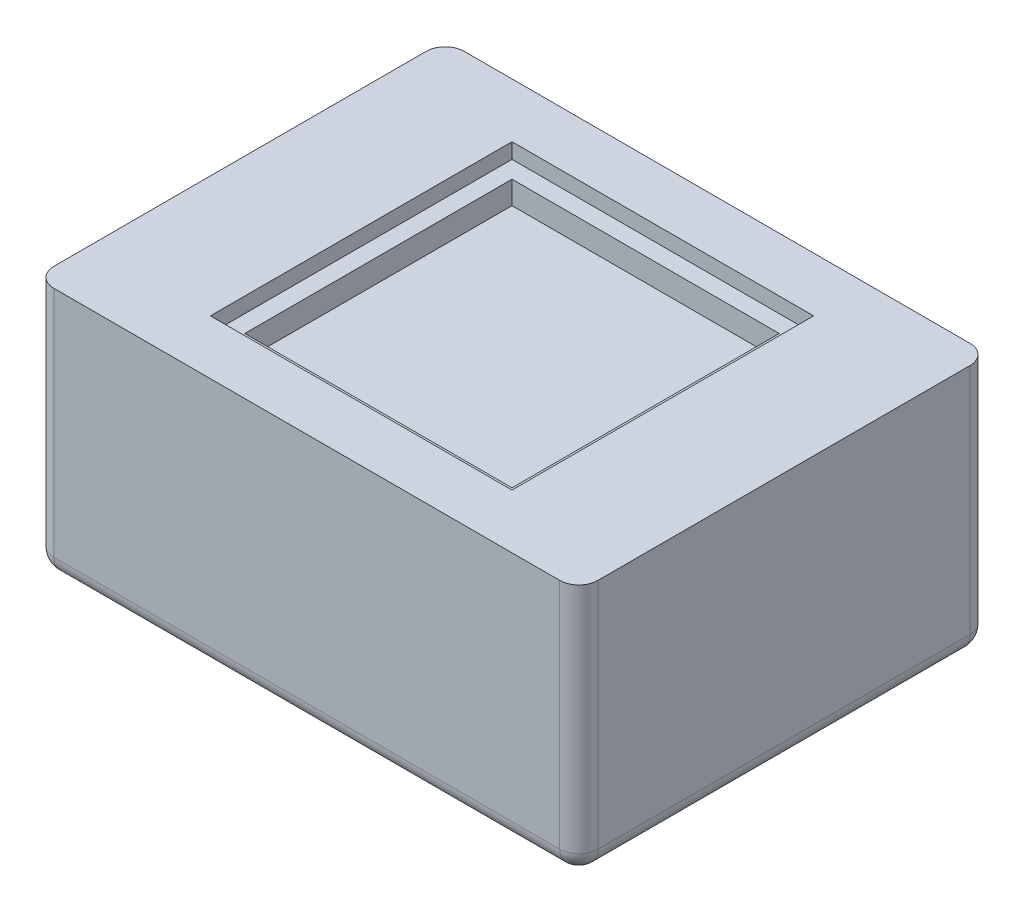
ISO-10303-21;
HEADER;
FILE_DESCRIPTION(('STEP AP214'),'2;1');
FILE_NAME('part.step','',(''),(''),'','','');
FILE_SCHEMA(('AUTOMOTIVE_DESIGN { 1 0 10303 214 1 1 1 1 }'));
ENDSEC;
DATA;
#1=APPLICATION_CONTEXT('core data for automotive mechanical design processes');
#2=APPLICATION_PROTOCOL_DEFINITION('international standard','automotive_design',2000,#1);
#3=PRODUCT_CONTEXT('',#1,'mechanical');
#4=PRODUCT('Part','Part','',(#3));
#5=PRODUCT_RELATED_PRODUCT_CATEGORY('part','',(#4));
#6=PRODUCT_DEFINITION_FORMATION('','',#4);
#7=PRODUCT_DEFINITION_CONTEXT('part definition',#1,'design');
#8=PRODUCT_DEFINITION('design','',#6,#7);
#9=PRODUCT_DEFINITION_SHAPE('','',#8);
#10=(LENGTH_UNIT() NAMED_UNIT(*) SI_UNIT(.MILLI.,.METRE.));
#11=(NAMED_UNIT(*) PLANE_ANGLE_UNIT() SI_UNIT($,.RADIAN.));
#12=(NAMED_UNIT(*) SI_UNIT($,.STERADIAN.) SOLID_ANGLE_UNIT());
#13=UNCERTAINTY_MEASURE_WITH_UNIT(LENGTH_MEASURE(1.E-05),#10,'distance_accuracy_value','');
#14=(GEOMETRIC_REPRESENTATION_CONTEXT(3) GLOBAL_UNCERTAINTY_ASSIGNED_CONTEXT((#13)) GLOBAL_UNIT_ASSIGNED_CONTEXT((#10,
#11,#12)) REPRESENTATION_CONTEXT('',''));
#15=CARTESIAN_POINT('',(0.,0.,0.));
#16=DIRECTION('',(0.,0.,1.));
#17=DIRECTION('',(1.,0.,0.));
#18=AXIS2_PLACEMENT_3D('',#15,#16,#17);
#19=CARTESIAN_POINT('',(14.25,13.2,-10.75));
#20=DIRECTION('',(-1.,0.,0.));
#21=DIRECTION('',(0.,0.,1.));
#22=AXIS2_PLACEMENT_3D('',#19,#20,#21);
#23=PLANE('',#22);
#24=DIRECTION('',(0.,-1.,0.));
#25=VECTOR('',#24,1.);
#26=CARTESIAN_POINT('',(14.25,13.2,9.75));
#27=LINE('',#26,#25);
#28=CARTESIAN_POINT('',(14.25,13.2,9.75));
#29=VERTEX_POINT('',#28);
#30=CARTESIAN_POINT('',(14.25,1.,9.75));
#31=VERTEX_POINT('',#30);
#32=EDGE_CURVE('E286',#29,#31,#27,.T.);
#33=ORIENTED_EDGE('',*,*,#32,.T.);
#34=DIRECTION('',(0.,0.,-1.));
#35=VECTOR('',#34,1.);
#36=CARTESIAN_POINT('',(14.25,1.,-10.75));
#37=LINE('',#36,#35);
#38=CARTESIAN_POINT('',(14.25,1.,-9.75));
#39=VERTEX_POINT('',#38);
#40=EDGE_CURVE('E341',#31,#39,#37,.T.);
#41=ORIENTED_EDGE('',*,*,#40,.T.);
#42=DIRECTION('',(0.,-1.,0.));
#43=VECTOR('',#42,1.);
#44=CARTESIAN_POINT('',(14.25,13.2,-9.75));
#45=LINE('',#44,#43);
#46=CARTESIAN_POINT('',(14.25,13.2,-9.75));
#47=VERTEX_POINT('',#46);
#48=EDGE_CURVE('E283',#39,#47,#45,.F.);
#49=ORIENTED_EDGE('',*,*,#48,.T.);
#50=DIRECTION('',(0.,0.,-1.));
#51=VECTOR('',#50,1.);
#52=CARTESIAN_POINT('',(14.25,13.2,-10.75));
#53=LINE('',#52,#51);
#54=EDGE_CURVE('E256',#29,#47,#53,.T.);
#55=ORIENTED_EDGE('',*,*,#54,.F.);
#56=EDGE_LOOP('',(#33,#41,#49,#55));
#57=FACE_BOUND('',#56,.T.);
#58=ADVANCED_FACE('F43',(#57),#23,.F.);
#59=CARTESIAN_POINT('',(-14.25,13.2,-10.75));
#60=DIRECTION('',(0.,0.,1.));
#61=DIRECTION('',(1.,0.,0.));
#62=AXIS2_PLACEMENT_3D('',#59,#60,#61);
#63=PLANE('',#62);
#64=DIRECTION('',(0.,-1.,0.));
#65=VECTOR('',#64,1.);
#66=CARTESIAN_POINT('',(13.25,13.2,-10.75));
#67=LINE('',#66,#65);
#68=CARTESIAN_POINT('',(13.25,13.2,-10.75));
#69=VERTEX_POINT('',#68);
#70=CARTESIAN_POINT('',(13.25,1.,-10.75));
#71=VERTEX_POINT('',#70);
#72=EDGE_CURVE('E314',#69,#71,#67,.T.);
#73=ORIENTED_EDGE('',*,*,#72,.T.);
#74=DIRECTION('',(-1.,0.,0.));
#75=VECTOR('',#74,1.);
#76=CARTESIAN_POINT('',(-14.25,1.,-10.75));
#77=LINE('',#76,#75);
#78=CARTESIAN_POINT('',(-13.25,1.,-10.75));
#79=VERTEX_POINT('',#78);
#80=EDGE_CURVE('E324',#71,#79,#77,.T.);
#81=ORIENTED_EDGE('',*,*,#80,.T.);
#82=DIRECTION('',(0.,-1.,0.));
#83=VECTOR('',#82,1.);
#84=CARTESIAN_POINT('',(-13.25,13.2,-10.75));
#85=LINE('',#84,#83);
#86=CARTESIAN_POINT('',(-13.25,13.2,-10.75));
#87=VERTEX_POINT('',#86);
#88=EDGE_CURVE('E318',#79,#87,#85,.F.);
#89=ORIENTED_EDGE('',*,*,#88,.T.);
#90=DIRECTION('',(-1.,0.,0.));
#91=VECTOR('',#90,1.);
#92=CARTESIAN_POINT('',(-14.25,13.2,-10.75));
#93=LINE('',#92,#91);
#94=EDGE_CURVE('E271',#69,#87,#93,.T.);
#95=ORIENTED_EDGE('',*,*,#94,.F.);
#96=EDGE_LOOP('',(#73,#81,#89,#95));
#97=FACE_BOUND('',#96,.T.);
#98=ADVANCED_FACE('F413',(#97),#63,.F.);
#99=CARTESIAN_POINT('',(-14.25,13.2,-10.75));
#100=DIRECTION('',(1.,0.,0.));
#101=DIRECTION('',(0.,0.,-1.));
#102=AXIS2_PLACEMENT_3D('',#99,#100,#101);
#103=PLANE('',#102);
#104=DIRECTION('',(0.,-1.,0.));
#105=VECTOR('',#104,1.);
#106=CARTESIAN_POINT('',(-14.25,13.2,-9.75));
#107=LINE('',#106,#105);
#108=CARTESIAN_POINT('',(-14.25,13.2,-9.75));
#109=VERTEX_POINT('',#108);
#110=CARTESIAN_POINT('',(-14.25,1.,-9.75));
#111=VERTEX_POINT('',#110);
#112=EDGE_CURVE('E308',#109,#111,#107,.T.);
#113=ORIENTED_EDGE('',*,*,#112,.T.);
#114=DIRECTION('',(0.,0.,1.));
#115=VECTOR('',#114,1.);
#116=CARTESIAN_POINT('',(-14.25,1.,-10.75));
#117=LINE('',#116,#115);
#118=CARTESIAN_POINT('',(-14.25,1.,9.75));
#119=VERTEX_POINT('',#118);
#120=EDGE_CURVE('E11',#111,#119,#117,.T.);
#121=ORIENTED_EDGE('',*,*,#120,.T.);
#122=DIRECTION('',(0.,-1.,0.));
#123=VECTOR('',#122,1.);
#124=CARTESIAN_POINT('',(-14.25,13.2,9.75));
#125=LINE('',#124,#123);
#126=CARTESIAN_POINT('',(-14.25,13.2,9.75));
#127=VERTEX_POINT('',#126);
#128=EDGE_CURVE('E311',#119,#127,#125,.F.);
#129=ORIENTED_EDGE('',*,*,#128,.T.);
#130=DIRECTION('',(0.,0.,1.));
#131=VECTOR('',#130,1.);
#132=CARTESIAN_POINT('',(-14.25,13.2,-10.75));
#133=LINE('',#132,#131);
#134=EDGE_CURVE('E275',#109,#127,#133,.T.);
#135=ORIENTED_EDGE('',*,*,#134,.F.);
#136=EDGE_LOOP('',(#113,#121,#129,#135));
#137=FACE_BOUND('',#136,.T.);
#138=ADVANCED_FACE('F423',(#137),#103,.F.);
#139=CARTESIAN_POINT('',(-14.25,13.2,10.75));
#140=DIRECTION('',(0.,0.,-1.));
#141=DIRECTION('',(-1.,0.,0.));
#142=AXIS2_PLACEMENT_3D('',#139,#140,#141);
#143=PLANE('',#142);
#144=DIRECTION('',(0.,-1.,0.));
#145=VECTOR('',#144,1.);
#146=CARTESIAN_POINT('',(-13.25,13.2,10.75));
#147=LINE('',#146,#145);
#148=CARTESIAN_POINT('',(-13.25,13.2,10.75));
#149=VERTEX_POINT('',#148);
#150=CARTESIAN_POINT('',(-13.25,1.,10.75));
#151=VERTEX_POINT('',#150);
#152=EDGE_CURVE('E290',#149,#151,#147,.T.);
#153=ORIENTED_EDGE('',*,*,#152,.T.);
#154=DIRECTION('',(1.,0.,0.));
#155=VECTOR('',#154,1.);
#156=CARTESIAN_POINT('',(-14.25,1.,10.75));
#157=LINE('',#156,#155);
#158=CARTESIAN_POINT('',(13.25,1.,10.75));
#159=VERTEX_POINT('',#158);
#160=EDGE_CURVE('E53',#151,#159,#157,.T.);
#161=ORIENTED_EDGE('',*,*,#160,.T.);
#162=DIRECTION('',(0.,-1.,0.));
#163=VECTOR('',#162,1.);
#164=CARTESIAN_POINT('',(13.25,13.2,10.75));
#165=LINE('',#164,#163);
#166=CARTESIAN_POINT('',(13.25,13.2,10.75));
#167=VERTEX_POINT('',#166);
#168=EDGE_CURVE('E293',#159,#167,#165,.F.);
#169=ORIENTED_EDGE('',*,*,#168,.T.);
#170=DIRECTION('',(1.,0.,0.));
#171=VECTOR('',#170,1.);
#172=CARTESIAN_POINT('',(-14.25,13.2,10.75));
#173=LINE('',#172,#171);
#174=EDGE_CURVE('E279',#149,#167,#173,.T.);
#175=ORIENTED_EDGE('',*,*,#174,.F.);
#176=EDGE_LOOP('',(#153,#161,#169,#175));
#177=FACE_BOUND('',#176,.T.);
#178=ADVANCED_FACE('F435',(#177),#143,.F.);
#179=CARTESIAN_POINT('',(0.,13.2,0.));
#180=DIRECTION('',(0.,1.,0.));
#181=DIRECTION('',(0.,0.,1.));
#182=AXIS2_PLACEMENT_3D('',#179,#180,#181);
#183=PLANE('',#182);
#184=DIRECTION('',(1.,0.,0.));
#185=VECTOR('',#184,1.);
#186=CARTESIAN_POINT('',(-7.9,13.2,7.9));
#187=LINE('',#186,#185);
#188=CARTESIAN_POINT('',(-7.9,13.2,7.9));
#189=VERTEX_POINT('',#188);
#190=CARTESIAN_POINT('',(7.9,13.2,7.9));
#191=VERTEX_POINT('',#190);
#192=EDGE_CURVE('E191',#189,#191,#187,.T.);
#193=ORIENTED_EDGE('',*,*,#192,.F.);
#194=DIRECTION('',(0.,0.,1.));
#195=VECTOR('',#194,1.);
#196=CARTESIAN_POINT('',(-7.9,13.2,-7.9));
#197=LINE('',#196,#195);
#198=CARTESIAN_POINT('',(-7.9,13.2,-7.9));
#199=VERTEX_POINT('',#198);
#200=EDGE_CURVE('E199',#199,#189,#197,.T.);
#201=ORIENTED_EDGE('',*,*,#200,.F.);
#202=DIRECTION('',(1.,0.,0.));
#203=VECTOR('',#202,1.);
#204=CARTESIAN_POINT('',(-7.9,13.2,-7.9));
#205=LINE('',#204,#203);
#206=CARTESIAN_POINT('',(7.9,13.2,-7.9));
#207=VERTEX_POINT('',#206);
#208=EDGE_CURVE('E203',#199,#207,#205,.T.);
#209=ORIENTED_EDGE('',*,*,#208,.T.);
#210=DIRECTION('',(0.,0.,1.));
#211=VECTOR('',#210,1.);
#212=CARTESIAN_POINT('',(7.9,13.2,-7.9));
#213=LINE('',#212,#211);
#214=EDGE_CURVE('E212',#207,#191,#213,.T.);
#215=ORIENTED_EDGE('',*,*,#214,.T.);
#216=EDGE_LOOP('',(#193,#201,#209,#215));
#217=FACE_BOUND('',#216,.T.);
#218=ORIENTED_EDGE('',*,*,#174,.T.);
#219=CARTESIAN_POINT('',(13.25,13.2,9.75));
#220=DIRECTION('',(0.,1.,0.));
#221=DIRECTION('',(0.,0.,1.));
#222=AXIS2_PLACEMENT_3D('',#219,#220,#221);
#223=CIRCLE('',#222,1.);
#224=EDGE_CURVE('E305',#167,#29,#223,.T.);
#225=ORIENTED_EDGE('',*,*,#224,.T.);
#226=ORIENTED_EDGE('',*,*,#54,.T.);
#227=CARTESIAN_POINT('',(13.25,13.2,-9.75));
#228=DIRECTION('',(0.,1.,0.));
#229=DIRECTION('',(0.,0.,1.));
#230=AXIS2_PLACEMENT_3D('',#227,#228,#229);
#231=CIRCLE('',#230,1.);
#232=EDGE_CURVE('E296',#47,#69,#231,.T.);
#233=ORIENTED_EDGE('',*,*,#232,.T.);
#234=ORIENTED_EDGE('',*,*,#94,.T.);
#235=CARTESIAN_POINT('',(-13.25,13.2,-9.75));
#236=DIRECTION('',(0.,1.,0.));
#237=DIRECTION('',(0.,0.,1.));
#238=AXIS2_PLACEMENT_3D('',#235,#236,#237);
#239=CIRCLE('',#238,1.);
#240=EDGE_CURVE('E299',#87,#109,#239,.T.);
#241=ORIENTED_EDGE('',*,*,#240,.T.);
#242=ORIENTED_EDGE('',*,*,#134,.T.);
#243=CARTESIAN_POINT('',(-13.25,13.2,9.75));
#244=DIRECTION('',(0.,1.,0.));
#245=DIRECTION('',(0.,0.,1.));
#246=AXIS2_PLACEMENT_3D('',#243,#244,#245);
#247=CIRCLE('',#246,1.);
#248=EDGE_CURVE('E302',#127,#149,#247,.T.);
#249=ORIENTED_EDGE('',*,*,#248,.T.);
#250=EDGE_LOOP('',(#218,#225,#226,#233,#234,#241,#242,#249));
#251=FACE_BOUND('',#250,.T.);
#252=ADVANCED_FACE('F410',(#217,#251),#183,.T.);
#253=CARTESIAN_POINT('',(0.,0.,0.));
#254=DIRECTION('',(0.,1.,0.));
#255=DIRECTION('',(0.,0.,1.));
#256=AXIS2_PLACEMENT_3D('',#253,#254,#255);
#257=PLANE('',#256);
#258=DIRECTION('',(0.,0.,1.));
#259=VECTOR('',#258,1.);
#260=CARTESIAN_POINT('',(-13.25,0.,0.));
#261=LINE('',#260,#259);
#262=CARTESIAN_POINT('',(-13.25,0.,9.75));
#263=VERTEX_POINT('',#262);
#264=CARTESIAN_POINT('',(-13.25,0.,-9.75));
#265=VERTEX_POINT('',#264);
#266=EDGE_CURVE('E328',#263,#265,#261,.F.);
#267=ORIENTED_EDGE('',*,*,#266,.T.);
#268=DIRECTION('',(-1.,0.,0.));
#269=VECTOR('',#268,1.);
#270=CARTESIAN_POINT('',(0.,0.,-9.75));
#271=LINE('',#270,#269);
#272=CARTESIAN_POINT('',(13.25,0.,-9.75));
#273=VERTEX_POINT('',#272);
#274=EDGE_CURVE('E337',#265,#273,#271,.F.);
#275=ORIENTED_EDGE('',*,*,#274,.T.);
#276=DIRECTION('',(0.,0.,-1.));
#277=VECTOR('',#276,1.);
#278=CARTESIAN_POINT('',(13.25,0.,0.));
#279=LINE('',#278,#277);
#280=CARTESIAN_POINT('',(13.25,0.,9.75));
#281=VERTEX_POINT('',#280);
#282=EDGE_CURVE('E334',#273,#281,#279,.F.);
#283=ORIENTED_EDGE('',*,*,#282,.T.);
#284=DIRECTION('',(1.,0.,0.));
#285=VECTOR('',#284,1.);
#286=CARTESIAN_POINT('',(0.,0.,9.75));
#287=LINE('',#286,#285);
#288=EDGE_CURVE('E331',#281,#263,#287,.F.);
#289=ORIENTED_EDGE('',*,*,#288,.T.);
#290=EDGE_LOOP('',(#267,#275,#283,#289));
#291=FACE_BOUND('',#290,.T.);
#292=ADVANCED_FACE('F432',(#291),#257,.F.);
#293=CARTESIAN_POINT('',(13.25,13.2,9.75));
#294=DIRECTION('',(0.,-1.,0.));
#295=DIRECTION('',(0.,0.,-1.));
#296=AXIS2_PLACEMENT_3D('',#293,#294,#295);
#297=CYLINDRICAL_SURFACE('',#296,1.);
#298=ORIENTED_EDGE('',*,*,#168,.F.);
#299=CARTESIAN_POINT('',(13.25,1.,9.75));
#300=DIRECTION('',(0.,-1.,0.));
#301=DIRECTION('',(0.,0.,-1.));
#302=AXIS2_PLACEMENT_3D('',#299,#300,#301);
#303=CIRCLE('',#302,1.);
#304=EDGE_CURVE('E344',#159,#31,#303,.F.);
#305=ORIENTED_EDGE('',*,*,#304,.T.);
#306=ORIENTED_EDGE('',*,*,#32,.F.);
#307=ORIENTED_EDGE('',*,*,#224,.F.);
#308=EDGE_LOOP('',(#298,#305,#306,#307));
#309=FACE_BOUND('',#308,.T.);
#310=ADVANCED_FACE('F439',(#309),#297,.T.);
#311=CARTESIAN_POINT('',(-13.25,13.2,9.75));
#312=DIRECTION('',(0.,-1.,0.));
#313=DIRECTION('',(0.,0.,-1.));
#314=AXIS2_PLACEMENT_3D('',#311,#312,#313);
#315=CYLINDRICAL_SURFACE('',#314,1.);
#316=ORIENTED_EDGE('',*,*,#128,.F.);
#317=CARTESIAN_POINT('',(-13.25,1.,9.75));
#318=DIRECTION('',(0.,-1.,0.));
#319=DIRECTION('',(0.,0.,-1.));
#320=AXIS2_PLACEMENT_3D('',#317,#318,#319);
#321=CIRCLE('',#320,1.);
#322=EDGE_CURVE('E61',#119,#151,#321,.F.);
#323=ORIENTED_EDGE('',*,*,#322,.T.);
#324=ORIENTED_EDGE('',*,*,#152,.F.);
#325=ORIENTED_EDGE('',*,*,#248,.F.);
#326=EDGE_LOOP('',(#316,#323,#324,#325));
#327=FACE_BOUND('',#326,.T.);
#328=ADVANCED_FACE('F424',(#327),#315,.T.);
#329=CARTESIAN_POINT('',(-13.25,13.2,-9.75));
#330=DIRECTION('',(0.,-1.,0.));
#331=DIRECTION('',(0.,0.,-1.));
#332=AXIS2_PLACEMENT_3D('',#329,#330,#331);
#333=CYLINDRICAL_SURFACE('',#332,1.);
#334=ORIENTED_EDGE('',*,*,#88,.F.);
#335=CARTESIAN_POINT('',(-13.25,1.,-9.75));
#336=DIRECTION('',(0.,-1.,0.));
#337=DIRECTION('',(0.,0.,-1.));
#338=AXIS2_PLACEMENT_3D('',#335,#336,#337);
#339=CIRCLE('',#338,1.);
#340=EDGE_CURVE('E350',#79,#111,#339,.F.);
#341=ORIENTED_EDGE('',*,*,#340,.T.);
#342=ORIENTED_EDGE('',*,*,#112,.F.);
#343=ORIENTED_EDGE('',*,*,#240,.F.);
#344=EDGE_LOOP('',(#334,#341,#342,#343));
#345=FACE_BOUND('',#344,.T.);
#346=ADVANCED_FACE('F418',(#345),#333,.T.);
#347=CARTESIAN_POINT('',(13.25,13.2,-9.75));
#348=DIRECTION('',(0.,-1.,0.));
#349=DIRECTION('',(0.,0.,-1.));
#350=AXIS2_PLACEMENT_3D('',#347,#348,#349);
#351=CYLINDRICAL_SURFACE('',#350,1.);
#352=ORIENTED_EDGE('',*,*,#48,.F.);
#353=CARTESIAN_POINT('',(13.25,1.,-9.75));
#354=DIRECTION('',(0.,-1.,0.));
#355=DIRECTION('',(0.,0.,-1.));
#356=AXIS2_PLACEMENT_3D('',#353,#354,#355);
#357=CIRCLE('',#356,1.);
#358=EDGE_CURVE('E347',#39,#71,#357,.F.);
#359=ORIENTED_EDGE('',*,*,#358,.T.);
#360=ORIENTED_EDGE('',*,*,#72,.F.);
#361=ORIENTED_EDGE('',*,*,#232,.F.);
#362=EDGE_LOOP('',(#352,#359,#360,#361));
#363=FACE_BOUND('',#362,.T.);
#364=ADVANCED_FACE('F406',(#363),#351,.T.);
#365=CARTESIAN_POINT('',(0.,12.4,0.));
#366=DIRECTION('',(0.,-1.,0.));
#367=DIRECTION('',(0.,0.,-1.));
#368=AXIS2_PLACEMENT_3D('',#365,#366,#367);
#369=PLANE('',#368);
#370=DIRECTION('',(1.,0.,0.));
#371=VECTOR('',#370,1.);
#372=CARTESIAN_POINT('',(-7.9,12.4,7.9));
#373=LINE('',#372,#371);
#374=CARTESIAN_POINT('',(-7.9,12.4,7.9));
#375=VERTEX_POINT('',#374);
#376=CARTESIAN_POINT('',(7.9,12.4,7.9));
#377=VERTEX_POINT('',#376);
#378=EDGE_CURVE('E184',#375,#377,#373,.T.);
#379=ORIENTED_EDGE('',*,*,#378,.T.);
#380=DIRECTION('',(0.,0.,1.));
#381=VECTOR('',#380,1.);
#382=CARTESIAN_POINT('',(7.9,12.4,-7.9));
#383=LINE('',#382,#381);
#384=CARTESIAN_POINT('',(7.9,12.4,-7.9));
#385=VERTEX_POINT('',#384);
#386=EDGE_CURVE('E172',#385,#377,#383,.T.);
#387=ORIENTED_EDGE('',*,*,#386,.F.);
#388=DIRECTION('',(1.,0.,0.));
#389=VECTOR('',#388,1.);
#390=CARTESIAN_POINT('',(-7.9,12.4,-7.9));
#391=LINE('',#390,#389);
#392=CARTESIAN_POINT('',(-7.9,12.4,-7.9));
#393=VERTEX_POINT('',#392);
#394=EDGE_CURVE('E183',#393,#385,#391,.T.);
#395=ORIENTED_EDGE('',*,*,#394,.F.);
#396=DIRECTION('',(0.,0.,1.));
#397=VECTOR('',#396,1.);
#398=CARTESIAN_POINT('',(-7.9,12.4,-7.9));
#399=LINE('',#398,#397);
#400=EDGE_CURVE('E193',#393,#375,#399,.T.);
#401=ORIENTED_EDGE('',*,*,#400,.T.);
#402=EDGE_LOOP('',(#379,#387,#395,#401));
#403=FACE_BOUND('',#402,.T.);
#404=DIRECTION('',(0.,0.,1.));
#405=VECTOR('',#404,1.);
#406=CARTESIAN_POINT('',(-7.,12.4,-7.));
#407=LINE('',#406,#405);
#408=CARTESIAN_POINT('',(-7.,12.4,-7.));
#409=VERTEX_POINT('',#408);
#410=CARTESIAN_POINT('',(-7.,12.4,7.));
#411=VERTEX_POINT('',#410);
#412=EDGE_CURVE('E229',#409,#411,#407,.T.);
#413=ORIENTED_EDGE('',*,*,#412,.F.);
#414=DIRECTION('',(1.,0.,0.));
#415=VECTOR('',#414,1.);
#416=CARTESIAN_POINT('',(-7.,12.4,-7.));
#417=LINE('',#416,#415);
#418=CARTESIAN_POINT('',(7.,12.4,-7.));
#419=VERTEX_POINT('',#418);
#420=EDGE_CURVE('E221',#409,#419,#417,.T.);
#421=ORIENTED_EDGE('',*,*,#420,.T.);
#422=DIRECTION('',(0.,0.,1.));
#423=VECTOR('',#422,1.);
#424=CARTESIAN_POINT('',(7.,12.4,-7.));
#425=LINE('',#424,#423);
#426=CARTESIAN_POINT('',(7.,12.4,7.));
#427=VERTEX_POINT('',#426);
#428=EDGE_CURVE('E321',#419,#427,#425,.T.);
#429=ORIENTED_EDGE('',*,*,#428,.T.);
#430=DIRECTION('',(1.,0.,0.));
#431=VECTOR('',#430,1.);
#432=CARTESIAN_POINT('',(-7.,12.4,7.));
#433=LINE('',#432,#431);
#434=EDGE_CURVE('E233',#411,#427,#433,.T.);
#435=ORIENTED_EDGE('',*,*,#434,.F.);
#436=EDGE_LOOP('',(#413,#421,#429,#435));
#437=FACE_BOUND('',#436,.T.);
#438=ADVANCED_FACE('F195',(#403,#437),#369,.F.);
#439=CARTESIAN_POINT('',(-7.9,12.4,7.9));
#440=DIRECTION('',(0.,0.,1.));
#441=DIRECTION('',(1.,0.,0.));
#442=AXIS2_PLACEMENT_3D('',#439,#440,#441);
#443=PLANE('',#442);
#444=ORIENTED_EDGE('',*,*,#192,.T.);
#445=DIRECTION('',(0.,1.,0.));
#446=VECTOR('',#445,1.);
#447=CARTESIAN_POINT('',(7.9,12.4,7.9));
#448=LINE('',#447,#446);
#449=EDGE_CURVE('E176',#377,#191,#448,.T.);
#450=ORIENTED_EDGE('',*,*,#449,.F.);
#451=ORIENTED_EDGE('',*,*,#378,.F.);
#452=DIRECTION('',(0.,1.,0.));
#453=VECTOR('',#452,1.);
#454=CARTESIAN_POINT('',(-7.9,12.4,7.9));
#455=LINE('',#454,#453);
#456=EDGE_CURVE('E218',#375,#189,#455,.T.);
#457=ORIENTED_EDGE('',*,*,#456,.T.);
#458=EDGE_LOOP('',(#444,#450,#451,#457));
#459=FACE_BOUND('',#458,.T.);
#460=ADVANCED_FACE('F188',(#459),#443,.F.);
#461=CARTESIAN_POINT('',(-7.9,12.4,-7.9));
#462=DIRECTION('',(-1.,0.,0.));
#463=DIRECTION('',(0.,0.,1.));
#464=AXIS2_PLACEMENT_3D('',#461,#462,#463);
#465=PLANE('',#464);
#466=ORIENTED_EDGE('',*,*,#200,.T.);
#467=ORIENTED_EDGE('',*,*,#456,.F.);
#468=ORIENTED_EDGE('',*,*,#400,.F.);
#469=DIRECTION('',(0.,1.,0.));
#470=VECTOR('',#469,1.);
#471=CARTESIAN_POINT('',(-7.9,12.4,-7.9));
#472=LINE('',#471,#470);
#473=EDGE_CURVE('E222',#393,#199,#472,.T.);
#474=ORIENTED_EDGE('',*,*,#473,.T.);
#475=EDGE_LOOP('',(#466,#467,#468,#474));
#476=FACE_BOUND('',#475,.T.);
#477=ADVANCED_FACE('F484',(#476),#465,.F.);
#478=CARTESIAN_POINT('',(-7.9,12.4,-7.9));
#479=DIRECTION('',(0.,0.,1.));
#480=DIRECTION('',(1.,0.,0.));
#481=AXIS2_PLACEMENT_3D('',#478,#479,#480);
#482=PLANE('',#481);
#483=ORIENTED_EDGE('',*,*,#208,.F.);
#484=ORIENTED_EDGE('',*,*,#473,.F.);
#485=ORIENTED_EDGE('',*,*,#394,.T.);
#486=DIRECTION('',(0.,1.,0.));
#487=VECTOR('',#486,1.);
#488=CARTESIAN_POINT('',(7.9,12.4,-7.9));
#489=LINE('',#488,#487);
#490=EDGE_CURVE('E178',#385,#207,#489,.T.);
#491=ORIENTED_EDGE('',*,*,#490,.T.);
#492=EDGE_LOOP('',(#483,#484,#485,#491));
#493=FACE_BOUND('',#492,.T.);
#494=ADVANCED_FACE('F487',(#493),#482,.T.);
#495=CARTESIAN_POINT('',(7.9,12.4,-7.9));
#496=DIRECTION('',(-1.,0.,0.));
#497=DIRECTION('',(0.,0.,1.));
#498=AXIS2_PLACEMENT_3D('',#495,#496,#497);
#499=PLANE('',#498);
#500=ORIENTED_EDGE('',*,*,#214,.F.);
#501=ORIENTED_EDGE('',*,*,#490,.F.);
#502=ORIENTED_EDGE('',*,*,#386,.T.);
#503=ORIENTED_EDGE('',*,*,#449,.T.);
#504=EDGE_LOOP('',(#500,#501,#502,#503));
#505=FACE_BOUND('',#504,.T.);
#506=ADVANCED_FACE('F175',(#505),#499,.T.);
#507=CARTESIAN_POINT('',(0.,11.2,0.));
#508=DIRECTION('',(0.,-1.,0.));
#509=DIRECTION('',(0.,0.,-1.));
#510=AXIS2_PLACEMENT_3D('',#507,#508,#509);
#511=PLANE('',#510);
#512=DIRECTION('',(1.,0.,0.));
#513=VECTOR('',#512,1.);
#514=CARTESIAN_POINT('',(-7.,11.2,7.));
#515=LINE('',#514,#513);
#516=CARTESIAN_POINT('',(-7.,11.2,7.));
#517=VERTEX_POINT('',#516);
#518=CARTESIAN_POINT('',(7.,11.2,7.));
#519=VERTEX_POINT('',#518);
#520=EDGE_CURVE('E237',#517,#519,#515,.T.);
#521=ORIENTED_EDGE('',*,*,#520,.T.);
#522=DIRECTION('',(0.,0.,1.));
#523=VECTOR('',#522,1.);
#524=CARTESIAN_POINT('',(7.,11.2,-7.));
#525=LINE('',#524,#523);
#526=CARTESIAN_POINT('',(7.,11.2,-7.));
#527=VERTEX_POINT('',#526);
#528=EDGE_CURVE('E241',#527,#519,#525,.T.);
#529=ORIENTED_EDGE('',*,*,#528,.F.);
#530=DIRECTION('',(1.,0.,0.));
#531=VECTOR('',#530,1.);
#532=CARTESIAN_POINT('',(-7.,11.2,-7.));
#533=LINE('',#532,#531);
#534=CARTESIAN_POINT('',(-7.,11.2,-7.));
#535=VERTEX_POINT('',#534);
#536=EDGE_CURVE('E244',#535,#527,#533,.T.);
#537=ORIENTED_EDGE('',*,*,#536,.F.);
#538=DIRECTION('',(0.,0.,1.));
#539=VECTOR('',#538,1.);
#540=CARTESIAN_POINT('',(-7.,11.2,-7.));
#541=LINE('',#540,#539);
#542=EDGE_CURVE('E247',#535,#517,#541,.T.);
#543=ORIENTED_EDGE('',*,*,#542,.T.);
#544=EDGE_LOOP('',(#521,#529,#537,#543));
#545=FACE_BOUND('',#544,.T.);
#546=ADVANCED_FACE('F471',(#545),#511,.F.);
#547=CARTESIAN_POINT('',(7.,11.2,-7.));
#548=DIRECTION('',(-1.,0.,0.));
#549=DIRECTION('',(0.,0.,1.));
#550=AXIS2_PLACEMENT_3D('',#547,#548,#549);
#551=PLANE('',#550);
#552=ORIENTED_EDGE('',*,*,#428,.F.);
#553=DIRECTION('',(0.,1.,0.));
#554=VECTOR('',#553,1.);
#555=CARTESIAN_POINT('',(7.,11.2,-7.));
#556=LINE('',#555,#554);
#557=EDGE_CURVE('E261',#527,#419,#556,.T.);
#558=ORIENTED_EDGE('',*,*,#557,.F.);
#559=ORIENTED_EDGE('',*,*,#528,.T.);
#560=DIRECTION('',(0.,1.,0.));
#561=VECTOR('',#560,1.);
#562=CARTESIAN_POINT('',(7.,11.2,7.));
#563=LINE('',#562,#561);
#564=EDGE_CURVE('E251',#519,#427,#563,.T.);
#565=ORIENTED_EDGE('',*,*,#564,.T.);
#566=EDGE_LOOP('',(#552,#558,#559,#565));
#567=FACE_BOUND('',#566,.T.);
#568=ADVANCED_FACE('F467',(#567),#551,.T.);
#569=CARTESIAN_POINT('',(-7.,11.2,-7.));
#570=DIRECTION('',(0.,0.,1.));
#571=DIRECTION('',(1.,0.,0.));
#572=AXIS2_PLACEMENT_3D('',#569,#570,#571);
#573=PLANE('',#572);
#574=ORIENTED_EDGE('',*,*,#420,.F.);
#575=DIRECTION('',(0.,1.,0.));
#576=VECTOR('',#575,1.);
#577=CARTESIAN_POINT('',(-7.,11.2,-7.));
#578=LINE('',#577,#576);
#579=EDGE_CURVE('E257',#535,#409,#578,.T.);
#580=ORIENTED_EDGE('',*,*,#579,.F.);
#581=ORIENTED_EDGE('',*,*,#536,.T.);
#582=ORIENTED_EDGE('',*,*,#557,.T.);
#583=EDGE_LOOP('',(#574,#580,#581,#582));
#584=FACE_BOUND('',#583,.T.);
#585=ADVANCED_FACE('F470',(#584),#573,.T.);
#586=CARTESIAN_POINT('',(-7.,11.2,-7.));
#587=DIRECTION('',(-1.,0.,0.));
#588=DIRECTION('',(0.,0.,1.));
#589=AXIS2_PLACEMENT_3D('',#586,#587,#588);
#590=PLANE('',#589);
#591=ORIENTED_EDGE('',*,*,#579,.T.);
#592=ORIENTED_EDGE('',*,*,#412,.T.);
#593=DIRECTION('',(0.,1.,0.));
#594=VECTOR('',#593,1.);
#595=CARTESIAN_POINT('',(-7.,11.2,7.));
#596=LINE('',#595,#594);
#597=EDGE_CURVE('E252',#517,#411,#596,.T.);
#598=ORIENTED_EDGE('',*,*,#597,.F.);
#599=ORIENTED_EDGE('',*,*,#542,.F.);
#600=EDGE_LOOP('',(#591,#592,#598,#599));
#601=FACE_BOUND('',#600,.T.);
#602=ADVANCED_FACE('F465',(#601),#590,.F.);
#603=CARTESIAN_POINT('',(-7.,11.2,7.));
#604=DIRECTION('',(0.,0.,1.));
#605=DIRECTION('',(1.,0.,0.));
#606=AXIS2_PLACEMENT_3D('',#603,#604,#605);
#607=PLANE('',#606);
#608=ORIENTED_EDGE('',*,*,#597,.T.);
#609=ORIENTED_EDGE('',*,*,#434,.T.);
#610=ORIENTED_EDGE('',*,*,#564,.F.);
#611=ORIENTED_EDGE('',*,*,#520,.F.);
#612=EDGE_LOOP('',(#608,#609,#610,#611));
#613=FACE_BOUND('',#612,.T.);
#614=ADVANCED_FACE('F462',(#613),#607,.F.);
#615=CARTESIAN_POINT('',(-14.25,1.,9.75));
#616=DIRECTION('',(1.,0.,0.));
#617=DIRECTION('',(0.,0.,-1.));
#618=AXIS2_PLACEMENT_3D('',#615,#616,#617);
#619=CYLINDRICAL_SURFACE('',#618,1.);
#620=CARTESIAN_POINT('',(13.25,1.,9.75));
#621=DIRECTION('',(1.,0.,0.));
#622=DIRECTION('',(0.,0.,-1.));
#623=AXIS2_PLACEMENT_3D('',#620,#621,#622);
#624=CIRCLE('',#623,1.);
#625=EDGE_CURVE('E47',#159,#281,#624,.T.);
#626=ORIENTED_EDGE('',*,*,#625,.F.);
#627=ORIENTED_EDGE('',*,*,#160,.F.);
#628=CARTESIAN_POINT('',(-13.25,1.,9.75));
#629=DIRECTION('',(-1.,0.,0.));
#630=DIRECTION('',(0.,0.,1.));
#631=AXIS2_PLACEMENT_3D('',#628,#629,#630);
#632=CIRCLE('',#631,1.);
#633=EDGE_CURVE('E378',#263,#151,#632,.T.);
#634=ORIENTED_EDGE('',*,*,#633,.F.);
#635=ORIENTED_EDGE('',*,*,#288,.F.);
#636=EDGE_LOOP('',(#626,#627,#634,#635));
#637=FACE_BOUND('',#636,.T.);
#638=ADVANCED_FACE('F45',(#637),#619,.T.);
#639=CARTESIAN_POINT('',(13.25,1.,9.75));
#640=DIRECTION('',(0.,1.,0.));
#641=DIRECTION('',(0.,0.,1.));
#642=AXIS2_PLACEMENT_3D('',#639,#640,#641);
#643=SPHERICAL_SURFACE('',#642,1.);
#644=ORIENTED_EDGE('',*,*,#304,.F.);
#645=ORIENTED_EDGE('',*,*,#625,.T.);
#646=CARTESIAN_POINT('',(13.25,1.,9.75));
#647=DIRECTION('',(0.,0.,-1.));
#648=DIRECTION('',(-1.,0.,0.));
#649=AXIS2_PLACEMENT_3D('',#646,#647,#648);
#650=CIRCLE('',#649,1.);
#651=EDGE_CURVE('E375',#31,#281,#650,.T.);
#652=ORIENTED_EDGE('',*,*,#651,.F.);
#653=EDGE_LOOP('',(#644,#645,#652));
#654=FACE_BOUND('',#653,.T.);
#655=ADVANCED_FACE('F390',(#654),#643,.T.);
#656=CARTESIAN_POINT('',(-13.25,1.,9.75));
#657=DIRECTION('',(0.,1.,0.));
#658=DIRECTION('',(0.,0.,1.));
#659=AXIS2_PLACEMENT_3D('',#656,#657,#658);
#660=SPHERICAL_SURFACE('',#659,1.);
#661=ORIENTED_EDGE('',*,*,#633,.T.);
#662=ORIENTED_EDGE('',*,*,#322,.F.);
#663=CARTESIAN_POINT('',(-13.25,1.,9.75));
#664=DIRECTION('',(0.,0.,-1.));
#665=DIRECTION('',(-1.,0.,0.));
#666=AXIS2_PLACEMENT_3D('',#663,#664,#665);
#667=CIRCLE('',#666,1.);
#668=EDGE_CURVE('E371',#263,#119,#667,.T.);
#669=ORIENTED_EDGE('',*,*,#668,.F.);
#670=EDGE_LOOP('',(#661,#662,#669));
#671=FACE_BOUND('',#670,.T.);
#672=ADVANCED_FACE('F425',(#671),#660,.T.);
#673=CARTESIAN_POINT('',(13.25,1.,-10.75));
#674=DIRECTION('',(0.,0.,-1.));
#675=DIRECTION('',(-1.,0.,0.));
#676=AXIS2_PLACEMENT_3D('',#673,#674,#675);
#677=CYLINDRICAL_SURFACE('',#676,1.);
#678=ORIENTED_EDGE('',*,*,#651,.T.);
#679=ORIENTED_EDGE('',*,*,#282,.F.);
#680=CARTESIAN_POINT('',(13.25,1.,-9.75));
#681=DIRECTION('',(0.,0.,-1.));
#682=DIRECTION('',(-1.,0.,0.));
#683=AXIS2_PLACEMENT_3D('',#680,#681,#682);
#684=CIRCLE('',#683,1.);
#685=EDGE_CURVE('E367',#39,#273,#684,.T.);
#686=ORIENTED_EDGE('',*,*,#685,.F.);
#687=ORIENTED_EDGE('',*,*,#40,.F.);
#688=EDGE_LOOP('',(#678,#679,#686,#687));
#689=FACE_BOUND('',#688,.T.);
#690=ADVANCED_FACE('F397',(#689),#677,.T.);
#691=CARTESIAN_POINT('',(-13.25,1.,-10.75));
#692=DIRECTION('',(0.,0.,1.));
#693=DIRECTION('',(1.,0.,0.));
#694=AXIS2_PLACEMENT_3D('',#691,#692,#693);
#695=CYLINDRICAL_SURFACE('',#694,1.);
#696=ORIENTED_EDGE('',*,*,#668,.T.);
#697=ORIENTED_EDGE('',*,*,#120,.F.);
#698=CARTESIAN_POINT('',(-13.25,1.,-9.75));
#699=DIRECTION('',(0.,0.,-1.));
#700=DIRECTION('',(-1.,0.,0.));
#701=AXIS2_PLACEMENT_3D('',#698,#699,#700);
#702=CIRCLE('',#701,1.);
#703=EDGE_CURVE('E363',#265,#111,#702,.T.);
#704=ORIENTED_EDGE('',*,*,#703,.F.);
#705=ORIENTED_EDGE('',*,*,#266,.F.);
#706=EDGE_LOOP('',(#696,#697,#704,#705));
#707=FACE_BOUND('',#706,.T.);
#708=ADVANCED_FACE('F428',(#707),#695,.T.);
#709=CARTESIAN_POINT('',(13.25,1.,-9.75));
#710=DIRECTION('',(0.,1.,0.));
#711=DIRECTION('',(0.,0.,1.));
#712=AXIS2_PLACEMENT_3D('',#709,#710,#711);
#713=SPHERICAL_SURFACE('',#712,1.);
#714=ORIENTED_EDGE('',*,*,#358,.F.);
#715=ORIENTED_EDGE('',*,*,#685,.T.);
#716=CARTESIAN_POINT('',(13.25,1.,-9.75));
#717=DIRECTION('',(-1.,0.,0.));
#718=DIRECTION('',(0.,0.,1.));
#719=AXIS2_PLACEMENT_3D('',#716,#717,#718);
#720=CIRCLE('',#719,1.);
#721=EDGE_CURVE('E360',#71,#273,#720,.T.);
#722=ORIENTED_EDGE('',*,*,#721,.F.);
#723=EDGE_LOOP('',(#714,#715,#722));
#724=FACE_BOUND('',#723,.T.);
#725=ADVANCED_FACE('F511',(#724),#713,.T.);
#726=CARTESIAN_POINT('',(-13.25,1.,-9.75));
#727=DIRECTION('',(0.,1.,0.));
#728=DIRECTION('',(0.,0.,1.));
#729=AXIS2_PLACEMENT_3D('',#726,#727,#728);
#730=SPHERICAL_SURFACE('',#729,1.);
#731=ORIENTED_EDGE('',*,*,#703,.T.);
#732=ORIENTED_EDGE('',*,*,#340,.F.);
#733=CARTESIAN_POINT('',(-13.25,1.,-9.75));
#734=DIRECTION('',(1.,0.,0.));
#735=DIRECTION('',(0.,0.,-1.));
#736=AXIS2_PLACEMENT_3D('',#733,#734,#735);
#737=CIRCLE('',#736,1.);
#738=EDGE_CURVE('E357',#265,#79,#737,.T.);
#739=ORIENTED_EDGE('',*,*,#738,.F.);
#740=EDGE_LOOP('',(#731,#732,#739));
#741=FACE_BOUND('',#740,.T.);
#742=ADVANCED_FACE('F507',(#741),#730,.T.);
#743=CARTESIAN_POINT('',(-14.25,1.,-9.75));
#744=DIRECTION('',(-1.,0.,0.));
#745=DIRECTION('',(0.,0.,1.));
#746=AXIS2_PLACEMENT_3D('',#743,#744,#745);
#747=CYLINDRICAL_SURFACE('',#746,1.);
#748=ORIENTED_EDGE('',*,*,#721,.T.);
#749=ORIENTED_EDGE('',*,*,#274,.F.);
#750=ORIENTED_EDGE('',*,*,#738,.T.);
#751=ORIENTED_EDGE('',*,*,#80,.F.);
#752=EDGE_LOOP('',(#748,#749,#750,#751));
#753=FACE_BOUND('',#752,.T.);
#754=ADVANCED_FACE('F504',(#753),#747,.T.);
#755=CLOSED_SHELL('',(#58,#98,#138,#178,#252,#292,#310,#328,#346,#364,#438,#460,#477,#494,#506,
#546,#568,#585,#602,#614,#638,#655,#672,#690,#708,#725,#742,#754));
#756=MANIFOLD_SOLID_BREP('B2',#755);
#757=ADVANCED_BREP_SHAPE_REPRESENTATION('',(#18,#756),#14);
#758=SHAPE_DEFINITION_REPRESENTATION(#9,#757);
ENDSEC;
END-ISO-10303-21;
